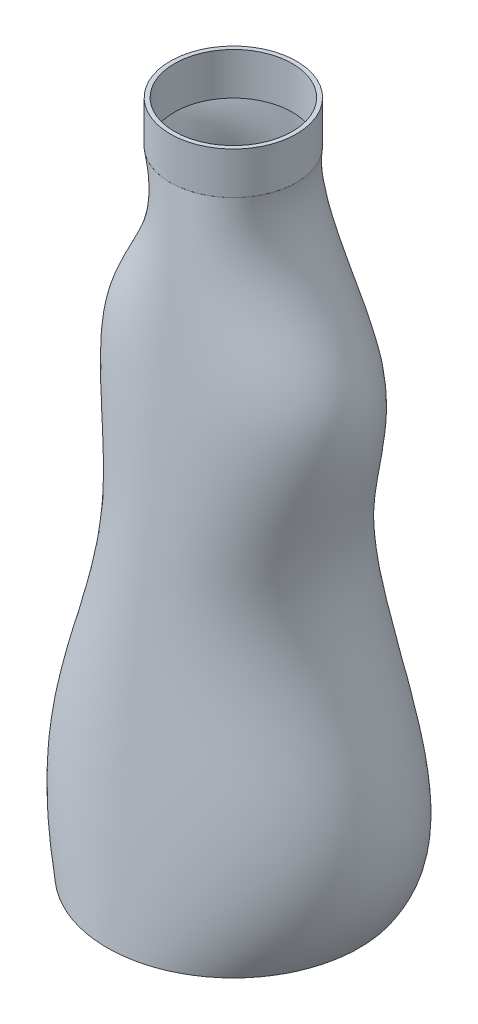
ISO-10303-21;
HEADER;
FILE_DESCRIPTION(('STEP AP214'),'2;1');
FILE_NAME('part.step','',(''),(''),'','','');
FILE_SCHEMA(('AUTOMOTIVE_DESIGN { 1 0 10303 214 1 1 1 1 }'));
ENDSEC;
DATA;
#1=APPLICATION_CONTEXT('core data for automotive mechanical design processes');
#2=APPLICATION_PROTOCOL_DEFINITION('international standard','automotive_design',2000,#1);
#3=PRODUCT_CONTEXT('',#1,'mechanical');
#4=PRODUCT('Part','Part','',(#3));
#5=PRODUCT_RELATED_PRODUCT_CATEGORY('part','',(#4));
#6=PRODUCT_DEFINITION_FORMATION('','',#4);
#7=PRODUCT_DEFINITION_CONTEXT('part definition',#1,'design');
#8=PRODUCT_DEFINITION('design','',#6,#7);
#9=PRODUCT_DEFINITION_SHAPE('','',#8);
#10=(LENGTH_UNIT() NAMED_UNIT(*) SI_UNIT(.MILLI.,.METRE.));
#11=(NAMED_UNIT(*) PLANE_ANGLE_UNIT() SI_UNIT($,.RADIAN.));
#12=(NAMED_UNIT(*) SI_UNIT($,.STERADIAN.) SOLID_ANGLE_UNIT());
#13=UNCERTAINTY_MEASURE_WITH_UNIT(LENGTH_MEASURE(1.E-05),#10,'distance_accuracy_value','');
#14=(GEOMETRIC_REPRESENTATION_CONTEXT(3) GLOBAL_UNCERTAINTY_ASSIGNED_CONTEXT((#13)) GLOBAL_UNIT_ASSIGNED_CONTEXT((#10,
#11,#12)) REPRESENTATION_CONTEXT('',''));
#15=CARTESIAN_POINT('',(0.,0.,0.));
#16=DIRECTION('',(0.,0.,1.));
#17=DIRECTION('',(1.,0.,0.));
#18=AXIS2_PLACEMENT_3D('',#15,#16,#17);
#19=CARTESIAN_POINT('',(0.,160.,0.));
#20=DIRECTION('',(0.,1.,0.));
#21=DIRECTION('',(0.,0.,1.));
#22=AXIS2_PLACEMENT_3D('',#19,#20,#21);
#23=PLANE('',#22);
#24=CARTESIAN_POINT('',(0.,160.,0.));
#25=DIRECTION('',(0.,1.,0.));
#26=DIRECTION('',(0.,0.,1.));
#27=AXIS2_PLACEMENT_3D('',#24,#25,#26);
#28=CIRCLE('',#27,15.);
#29=CARTESIAN_POINT('',(0.,160.,15.));
#30=VERTEX_POINT('',#29);
#31=EDGE_CURVE('E13',#30,#30,#28,.T.);
#32=ORIENTED_EDGE('',*,*,#31,.T.);
#33=EDGE_LOOP('',(#32));
#34=FACE_BOUND('',#33,.T.);
#35=CARTESIAN_POINT('',(0.,160.,0.));
#36=DIRECTION('',(0.,1.,0.));
#37=DIRECTION('',(0.,0.,1.));
#38=AXIS2_PLACEMENT_3D('',#35,#36,#37);
#39=CIRCLE('',#38,14.);
#40=CARTESIAN_POINT('',(0.,160.,14.));
#41=VERTEX_POINT('',#40);
#42=EDGE_CURVE('E104',#41,#41,#39,.T.);
#43=ORIENTED_EDGE('',*,*,#42,.F.);
#44=EDGE_LOOP('',(#43));
#45=FACE_BOUND('',#44,.T.);
#46=ADVANCED_FACE('F91',(#34,#45),#23,.T.);
#47=CARTESIAN_POINT('',(0.,150.,0.));
#48=DIRECTION('',(0.,1.,0.));
#49=DIRECTION('',(0.,0.,1.));
#50=AXIS2_PLACEMENT_3D('',#47,#48,#49);
#51=PLANE('',#50);
#52=CARTESIAN_POINT('',(0.,150.,0.));
#53=DIRECTION('',(0.,1.,0.));
#54=DIRECTION('',(0.,0.,1.));
#55=AXIS2_PLACEMENT_3D('',#52,#53,#54);
#56=CIRCLE('',#55,15.);
#57=CARTESIAN_POINT('',(0.,150.,15.));
#58=VERTEX_POINT('',#57);
#59=EDGE_CURVE('E95',#58,#58,#56,.T.);
#60=ORIENTED_EDGE('',*,*,#59,.F.);
#61=EDGE_LOOP('',(#60));
#62=FACE_BOUND('',#61,.T.);
#63=CARTESIAN_POINT('',(0.,150.,0.));
#64=DIRECTION('',(0.,1.,0.));
#65=DIRECTION('',(0.,0.,1.));
#66=AXIS2_PLACEMENT_3D('',#63,#64,#65);
#67=CIRCLE('',#66,14.);
#68=CARTESIAN_POINT('',(0.,150.,14.));
#69=VERTEX_POINT('',#68);
#70=EDGE_CURVE('E106',#69,#69,#67,.T.);
#71=ORIENTED_EDGE('',*,*,#70,.T.);
#72=EDGE_LOOP('',(#71));
#73=FACE_BOUND('',#72,.T.);
#74=ADVANCED_FACE('F118',(#62,#73),#51,.F.);
#75=CARTESIAN_POINT('',(0.,160.,0.));
#76=DIRECTION('',(0.,-1.,0.));
#77=DIRECTION('',(0.,0.,-1.));
#78=AXIS2_PLACEMENT_3D('',#75,#76,#77);
#79=CYLINDRICAL_SURFACE('',#78,15.);
#80=ORIENTED_EDGE('',*,*,#31,.F.);
#81=EDGE_LOOP('',(#80));
#82=FACE_BOUND('',#81,.T.);
#83=ORIENTED_EDGE('',*,*,#59,.T.);
#84=EDGE_LOOP('',(#83));
#85=FACE_BOUND('',#84,.T.);
#86=ADVANCED_FACE('F93',(#82,#85),#79,.T.);
#87=CARTESIAN_POINT('',(0.,160.,0.));
#88=DIRECTION('',(0.,-1.,0.));
#89=DIRECTION('',(0.,0.,-1.));
#90=AXIS2_PLACEMENT_3D('',#87,#88,#89);
#91=CYLINDRICAL_SURFACE('',#90,14.);
#92=ORIENTED_EDGE('',*,*,#42,.T.);
#93=EDGE_LOOP('',(#92));
#94=FACE_BOUND('',#93,.T.);
#95=ORIENTED_EDGE('',*,*,#70,.F.);
#96=EDGE_LOOP('',(#95));
#97=FACE_BOUND('',#96,.T.);
#98=ADVANCED_FACE('F114',(#94,#97),#91,.F.);
#99=CLOSED_SHELL('',(#46,#74,#86,#98));
#100=MANIFOLD_SOLID_BREP('B2',#99);
#101=CARTESIAN_POINT('',(-15.,150.,9.05048605504E-12));
#102=CARTESIAN_POINT('',(-7.95467335882661,136.319703010843,0.));
#103=CARTESIAN_POINT('',(-22.167178880164,124.484007588772,0.));
#104=CARTESIAN_POINT('',(-26.7282842244557,100.815131363639,0.));
#105=CARTESIAN_POINT('',(-21.9299743230444,87.0723177277878,0.));
#106=CARTESIAN_POINT('',(-22.7907471916141,50.3514765597343,0.));
#107=CARTESIAN_POINT('',(-42.763162800317,26.3102953532345,0.));
#108=CARTESIAN_POINT('',(-30.,0.,6.30348637870037E-11));
#109=CARTESIAN_POINT('',(-15.,150.,-0.924207898323756));
#110=CARTESIAN_POINT('',(-7.95467335882661,136.319703010843,-1.00300104803687));
#111=CARTESIAN_POINT('',(-22.167178880164,124.484007588772,-1.08944172404855));
#112=CARTESIAN_POINT('',(-26.7282842244557,100.815131363639,-1.23899337161657));
#113=CARTESIAN_POINT('',(-21.9299743230444,87.0723177277878,-1.31840309749387));
#114=CARTESIAN_POINT('',(-22.7907471916141,50.3514765597343,-1.540031720978));
#115=CARTESIAN_POINT('',(-42.763162800317,26.3102953532345,-1.69854937290577));
#116=CARTESIAN_POINT('',(-30.,0.,-1.84841579675716));
#117=CARTESIAN_POINT('',(-14.8277305557381,150.,-2.7634941832689));
#118=CARTESIAN_POINT('',(-7.87090558040959,136.316690346913,-2.99769173433498));
#119=CARTESIAN_POINT('',(-21.8715355365745,124.482458997463,-3.26033897363545));
#120=CARTESIAN_POINT('',(-26.3569865002133,100.820037600145,-3.71427633186735));
#121=CARTESIAN_POINT('',(-21.6499844228838,87.0774440269274,-3.95462320211574));
#122=CARTESIAN_POINT('',(-22.5492315629632,50.3527730652556,-4.62587140618732));
#123=CARTESIAN_POINT('',(-42.1641634587696,26.3140378608362,-5.10700025172343));
#124=CARTESIAN_POINT('',(-29.6573557938763,0.,-5.56102145394898));
#125=CARTESIAN_POINT('',(-14.0803696810469,150.,-5.40984495131868));
#126=CARTESIAN_POINT('',(-7.47996828703641,136.304263108206,-5.86265766268574));
#127=CARTESIAN_POINT('',(-20.597173537553,124.476071058313,-6.38870993203111));
#128=CARTESIAN_POINT('',(-24.7543405576161,100.840275825733,-7.29638777611129));
#129=CARTESIAN_POINT('',(-20.4154386899175,87.0985900108783,-7.77481408287762));
#130=CARTESIAN_POINT('',(-21.4497776816758,50.3581211505311,-9.11235416893317));
#131=CARTESIAN_POINT('',(-39.5734111217983,26.3294757046933,-10.0742468112128));
#132=CARTESIAN_POINT('',(-28.1084631643685,0.,-10.9792799560705));
#133=CARTESIAN_POINT('',(-12.8719037225451,150.,-7.85842693573967));
#134=CARTESIAN_POINT('',(-6.81329303507161,136.285057375659,-8.50722883208463));
#135=CARTESIAN_POINT('',(-18.5553501288918,124.466198788719,-9.28469375862589));
#136=CARTESIAN_POINT('',(-22.1882915625447,100.87155308346,-10.6242303603981));
#137=CARTESIAN_POINT('',(-18.4094009597049,87.1312701678935,-11.3275402024259));
#138=CARTESIAN_POINT('',(-19.6280989088162,50.3663863732296,-13.2954791762557));
#139=CARTESIAN_POINT('',(-35.4298408994546,26.3533341906544,-14.7147221551264));
#140=CARTESIAN_POINT('',(-25.5590553143517,0.,-16.04670192565));
#141=CARTESIAN_POINT('',(-11.2541874303604,150.,-10.0403628410517));
#142=CARTESIAN_POINT('',(-5.88585980934822,136.260202898245,-10.8536510409236));
#143=CARTESIAN_POINT('',(-15.8365011091999,124.453422910419,-11.8586342679285));
#144=CARTESIAN_POINT('',(-18.7708486906573,100.912029534635,-13.5876952069661));
#145=CARTESIAN_POINT('',(-15.7060933654478,87.1735621357955,-14.4920748799961));
#146=CARTESIAN_POINT('',(-17.1343240566392,50.3770825437806,-17.0246761036641));
#147=CARTESIAN_POINT('',(-29.9109367739726,26.3842098783687,-18.8561019724151));
#148=CARTESIAN_POINT('',(-22.0843102434634,0.,-20.5707059495825));
#149=CARTESIAN_POINT('',(-9.27907555462046,150.,-11.8867753717744));
#150=CARTESIAN_POINT('',(-4.71604025866252,136.230829424937,-12.8255690580771));
#151=CARTESIAN_POINT('',(-12.5381747940284,124.438324145157,-14.0238089970591));
#152=CARTESIAN_POINT('',(-14.6275711095836,100.95986534057,-16.0822624465797));
#153=CARTESIAN_POINT('',(-12.396706236904,87.2235435524067,-17.154690361128));
#154=CARTESIAN_POINT('',(-14.0450901741538,50.3897234726135,-20.1603085638643));
#155=CARTESIAN_POINT('',(-23.2275143824883,26.4206993274856,-22.3398103663339));
#156=CARTESIAN_POINT('',(-17.7991886308714,0.,-24.3751199038282));
#157=CARTESIAN_POINT('',(-7.01539591690821,150.,-13.3498728296974));
#158=CARTESIAN_POINT('',(-3.34076056461887,136.198066704709,-14.3680795527609));
#159=CARTESIAN_POINT('',(-8.7782089869827,124.421483214671,-15.7153492392906));
#160=CARTESIAN_POINT('',(-9.90730913380359,101.013220662574,-18.0259612198429));
#161=CARTESIAN_POINT('',(-8.59731488736682,87.27929205555,-19.224577070686));
#162=CARTESIAN_POINT('',(-10.4663676133847,50.4038229701579,-22.5866886826892));
#163=CARTESIAN_POINT('',(-15.6229042810837,26.4613990976544,-25.0319568891909));
#164=CARTESIAN_POINT('',(-12.8541740513776,0.,-27.3091538304579));
#165=CARTESIAN_POINT('',(-4.53197633880652,150.,-14.38186351661));
#166=CARTESIAN_POINT('',(-1.79948669194161,136.163044486534,-15.4290990068731));
#167=CARTESIAN_POINT('',(-4.67976756484791,124.403480840704,-16.8742995993839));
#168=CARTESIAN_POINT('',(-4.76905973184618,101.070255661958,-19.348086063821));
#169=CARTESIAN_POINT('',(-4.43670094173885,87.3388852830481,-20.6250327084199));
#170=CARTESIAN_POINT('',(-6.52397691581499,50.4188948468433,-24.2101674032009));
#171=CARTESIAN_POINT('',(-7.36539680233896,26.5049057485245,-26.8263628667003));
#172=CARTESIAN_POINT('',(-7.42954058351129,0.,-29.2550928949908));
#173=CARTESIAN_POINT('',(-1.90820880728182,150.,-14.9593692073532));
#174=CARTESIAN_POINT('',(-0.143191171178197,136.126892519386,-15.9822239871877));
#175=CARTESIAN_POINT('',(-0.37855483842242,124.384897744996,-17.4687743139448));
#176=CARTESIAN_POINT('',(0.613850990808201,101.129130500031,-20.0074052128264));
#177=CARTESIAN_POINT('',(-0.0589249368336713,87.4004008727236,-21.3101051947067));
#178=CARTESIAN_POINT('',(-2.3616683098486,50.4344529130993,-24.9714086028043));
#179=CARTESIAN_POINT('',(1.25689209398311,26.5498158397453,-27.653710754201));
#180=CARTESIAN_POINT('',(-1.72718040078507,0.,-30.1344925180515));
#181=CARTESIAN_POINT('',(0.776514690699449,150.,-15.0590116767678));
#182=CARTESIAN_POINT('',(1.5760706762384,136.090740552239,-16.0047573589449));
#183=CARTESIAN_POINT('',(3.98745420592102,124.366314649288,-17.4746599434055));
#184=CARTESIAN_POINT('',(6.06377108509192,101.188005338105,-19.9774938852961));
#185=CARTESIAN_POINT('',(4.38653548295192,87.4619164623991,-21.2523847352298));
#186=CARTESIAN_POINT('',(1.86834520460366,50.4500109793553,-24.840043485351));
#187=CARTESIAN_POINT('',(9.94520529601329,26.5947259309661,-27.4811067396811));
#188=CARTESIAN_POINT('',(4.03831367745115,0.,-29.9123813197661));
#189=CARTESIAN_POINT('',(3.439475707008,150.,-14.6834904331691));
#190=CARTESIAN_POINT('',(3.30297982079954,136.055718334064,-15.5017095765808));
#191=CARTESIAN_POINT('',(8.27708971752686,124.348312275321,-16.8973386840823));
#192=CARTESIAN_POINT('',(11.3999728448055,101.245040337489,-19.2645164482412));
#193=CARTESIAN_POINT('',(8.74719016023517,87.5215096898973,-20.4586932939982));
#194=CARTESIAN_POINT('',(6.01101462593293,50.4650828560407,-23.82451945572));
#195=CARTESIAN_POINT('',(18.3980759381141,26.6382325818362,-26.3177521888561));
#196=CARTESIAN_POINT('',(9.64975843592687,0.,-28.5989831219045));
#197=CARTESIAN_POINT('',(5.99795579351456,150.,-13.8355049848722));
#198=CARTESIAN_POINT('',(4.98286946577293,136.022955613836,-14.4818968371431));
#199=CARTESIAN_POINT('',(12.3505496158731,124.331471344836,-15.7501735962852));
#200=CARTESIAN_POINT('',(16.4443342903128,101.298395659493,-17.8898415407916));
#201=CARTESIAN_POINT('',(12.8738120008581,87.5772581930406,-18.9548926306433));
#202=CARTESIAN_POINT('',(9.91638860991665,50.4791823535851,-21.9630284711016));
#203=CARTESIAN_POINT('',(26.3204469871232,26.678932352005,-24.2102494896985));
#204=CARTESIAN_POINT('',(14.8976210539275,0.,-26.2491613804502));
#205=CARTESIAN_POINT('',(8.37333376724309,150.,-12.5440385171603));
#206=CARTESIAN_POINT('',(6.56626921784566,135.993582140528,-12.9817148371162));
#207=CARTESIAN_POINT('',(16.0744340425749,124.316372579573,-14.0755288325083));
#208=CARTESIAN_POINT('',(21.027221859923,101.346231465428,-15.9062984023008));
#209=CARTESIAN_POINT('',(16.626770067907,87.6272396096517,-16.7996110676241));
#210=CARTESIAN_POINT('',(13.4472036152571,50.491823282418,-19.3301739286521));
#211=CARTESIAN_POINT('',(33.4321604813936,26.7154218011219,-21.2442194319933));
#212=CARTESIAN_POINT('',(19.5893583690874,0.,-22.9592626380116));
#213=CARTESIAN_POINT('',(10.4869884452176,150.,-10.8380742153162));
#214=CARTESIAN_POINT('',(8.00590965377287,135.968727663114,-11.0406508053908));
#215=CARTESIAN_POINT('',(19.3199587017172,124.303596701274,-11.9222516688263));
#216=CARTESIAN_POINT('',(24.9877950584381,101.386707916603,-13.379067212469));
#217=CARTESIAN_POINT('',(19.8774446841725,87.6695315775537,-14.0669435921701));
#218=CARTESIAN_POINT('',(16.4833982280738,50.502519452969,-16.0247217233023));
#219=CARTESIAN_POINT('',(39.4746885427865,26.7462974888362,-17.5356649107124));
#220=CARTESIAN_POINT('',(23.558243599384,0.,-18.8618957097327));
#221=CARTESIAN_POINT('',(12.2714350017375,150.,-8.77126648497149));
#222=CARTESIAN_POINT('',(9.26746969947951,135.949521930567,-8.72325565603079));
#223=CARTESIAN_POINT('',(21.9732755072359,124.293724431679,-9.36468362326683));
#224=CARTESIAN_POINT('',(28.1835888128569,101.41798517433,-10.3995673023917));
#225=CARTESIAN_POINT('',(22.5174177658272,87.7022117345688,-10.8576198788668));
#226=CARTESIAN_POINT('',(18.930209381467,50.5107846756675,-12.1731763586731));
#227=CARTESIAN_POINT('',(44.2184470420787,26.7701559747972,-13.2291169981889));
#228=CARTESIAN_POINT('',(26.6699401629107,0.,-14.1189440654462));
#229=CARTESIAN_POINT('',(13.6591886111024,150.,-6.39726973175732));
#230=CARTESIAN_POINT('',(10.3198378930239,135.937094691859,-6.09585763053348));
#231=CARTESIAN_POINT('',(23.927267116715,124.287336492529,-6.48089337303864));
#232=CARTESIAN_POINT('',(30.4849607292844,101.438223399918,-7.06631858055345));
#233=CARTESIAN_POINT('',(24.4543286363042,87.7233577185198,-7.2812614151552));
#234=CARTESIAN_POINT('',(20.7179593823361,50.5161327609429,-7.91593340097258));
#235=CARTESIAN_POINT('',(47.4653943864409,26.7855938186544,-8.48657349261429));
#236=CARTESIAN_POINT('',(28.8277587719206,0.,-8.91313841942317));
#237=CARTESIAN_POINT('',(14.287665451931,150.,-4.66012619711323));
#238=CARTESIAN_POINT('',(10.8751387656181,135.93408202793,-4.19580744240405));
#239=CARTESIAN_POINT('',(24.7075018276726,124.28578790122,-4.40633033905837));
#240=CARTESIAN_POINT('',(31.3539117591397,101.443129636424,-4.6863637162739));
#241=CARTESIAN_POINT('',(25.2339069819322,87.7284840176593,-4.73722708516494));
#242=CARTESIAN_POINT('',(21.4458291484956,50.5174292664642,-4.91118169573419));
#243=CARTESIAN_POINT('',(48.5243295531183,26.7893363262561,-5.15139287133595));
#244=CARTESIAN_POINT('',(29.5923470147349,0.,-5.26399459699668));
#245=CARTESIAN_POINT('',(14.7805699576064,150.,-2.75950543045058));
#246=CARTESIAN_POINT('',(11.3849481728508,135.93408202793,-2.12961323882681));
#247=CARTESIAN_POINT('',(25.2316022994327,124.28578790122,-2.15677736405663));
#248=CARTESIAN_POINT('',(31.8919387820162,101.443129636424,-2.11618646287646));
#249=CARTESIAN_POINT('',(25.7736627885576,87.7284840176593,-1.99540517666622));
#250=CARTESIAN_POINT('',(21.9692948261949,50.5174292664642,-1.68664633006411));
#251=CARTESIAN_POINT('',(49.0169352926142,26.7893363262561,-1.57941388545242));
#252=CARTESIAN_POINT('',(30.0410297277784,0.,-1.36272039141552));
#253=CARTESIAN_POINT('',(15.0922725668329,150.,-0.684554222597238));
#254=CARTESIAN_POINT('',(11.7946663677356,135.937094691859,0.114646395355562));
#255=CARTESIAN_POINT('',(25.4361916180255,124.287336492529,0.280430085278462));
#256=CARTESIAN_POINT('',(32.0231790740801,101.438223399918,0.657314906343572));
#257=CARTESIAN_POINT('',(25.9925200534281,87.7233577185197,0.957188710889697));
#258=CARTESIAN_POINT('',(22.1980091784136,50.5161327609429,1.76941421982859));
#259=CARTESIAN_POINT('',(48.851035357193,26.7855938186544,2.23966911932784));
#260=CARTESIAN_POINT('',(30.0835882958598,0.,2.79942894239995));
#261=CARTESIAN_POINT('',(14.9092202038711,150.,2.47700622480828));
#262=CARTESIAN_POINT('',(11.9655359245134,135.949521930567,3.50338566110094));
#263=CARTESIAN_POINT('',(24.7174968621225,124.293724431679,3.94333782193483));
#264=CARTESIAN_POINT('',(30.9569610496404,101.41798517433,4.79529336336801));
#265=CARTESIAN_POINT('',(25.2796650041254,87.7022117345687,5.34568814178303));
#266=CARTESIAN_POINT('',(21.5622654040142,50.5107846756674,6.86185126045047));
#267=CARTESIAN_POINT('',(46.6671947848337,26.7701559747972,7.84154142127975));
#268=CARTESIAN_POINT('',(28.8761406678109,0.,8.8800691413998));
#269=CARTESIAN_POINT('',(14.0552277202822,150.,5.54802624131384));
#270=CARTESIAN_POINT('',(11.6430046152447,135.968727663114,6.76719411726017));
#271=CARTESIAN_POINT('',(23.0069318222546,124.303596701274,7.45567375017954));
#272=CARTESIAN_POINT('',(28.6959341472756,101.386707916603,8.7357355877943));
#273=CARTESIAN_POINT('',(23.5626494674184,87.6695315775537,9.50953180471057));
#274=CARTESIAN_POINT('',(19.9772441767578,50.5025194529689,11.6532943440638));
#275=CARTESIAN_POINT('',(42.7158152139608,26.7462974888362,13.0891313270041));
#276=CARTESIAN_POINT('',(26.4714987326123,0.,14.553764914739));
#277=CARTESIAN_POINT('',(12.5749834699442,150.,8.38791181353351));
#278=CARTESIAN_POINT('',(10.8404298947317,135.993582140528,9.75985406920887));
#279=CARTESIAN_POINT('',(20.399092559867,124.316372579573,10.6630077592051));
#280=CARTESIAN_POINT('',(25.3655133865839,101.346231465428,12.3103807599022));
#281=CARTESIAN_POINT('',(20.9336122967326,87.6272396096518,13.273455541018));
#282=CARTESIAN_POINT('',(17.5220960080823,50.491823282418,15.9489809223638));
#283=CARTESIAN_POINT('',(37.2099944471501,26.7154218011219,17.7734754606047));
#284=CARTESIAN_POINT('',(22.9856497419829,0.,19.5984939309405));
#285=CARTESIAN_POINT('',(10.5131758067351,150.,10.8560689280813));
#286=CARTESIAN_POINT('',(9.57437200942687,136.022955613836,12.3375872167494));
#287=CARTESIAN_POINT('',(16.9952915771028,124.331471344836,13.4160252904454));
#288=CARTESIAN_POINT('',(21.1039092178491,101.298395659493,15.3607136524756));
#289=CARTESIAN_POINT('',(17.5007156304782,87.5772581930405,16.4743992678557));
#290=CARTESIAN_POINT('',(14.3010034763599,50.4791823535851,19.5732140283364));
#291=CARTESIAN_POINT('',(30.3943057949213,26.678932352005,21.7095836505127));
#292=CARTESIAN_POINT('',(18.5721482406325,0.,23.8208468484278));
#293=CARTESIAN_POINT('',(7.97332320716747,150.,12.8435225298613));
#294=CARTESIAN_POINT('',(7.9178543519894,136.055718334064,14.3884355563011));
#295=CARTESIAN_POINT('',(12.9507078112613,124.348312275321,15.5974529618267));
#296=CARTESIAN_POINT('',(16.0987059376769,101.245040337489,17.7606423606841));
#297=CARTESIAN_POINT('',(13.4191099547746,87.5215096898972,18.9819291386097));
#298=CARTESIAN_POINT('',(10.4584796988456,50.4650828560407,22.3834892537384));
#299=CARTESIAN_POINT('',(22.5488911756341,26.6382325818362,24.7460633404484));
#300=CARTESIAN_POINT('',(13.4156153362751,0.,27.0613948911472));
#301=CARTESIAN_POINT('',(5.05894414775401,150.,14.2412975637775));
#302=CARTESIAN_POINT('',(5.94600704123709,136.090740552239,15.8037047504521));
#303=CARTESIAN_POINT('',(8.42493812714203,124.366314649288,17.0968614893846));
#304=CARTESIAN_POINT('',(10.5459043965663,101.188005338105,19.3971136093674));
#305=CARTESIAN_POINT('',(8.85448552145438,87.4619164623991,20.6819391415118));
#306=CARTESIAN_POINT('',(6.15550333784666,50.4500109793552,24.2628100343884));
#307=CARTESIAN_POINT('',(13.9745964069882,26.5947259309661,26.7635957277896));
#308=CARTESIAN_POINT('',(7.72538307866728,0.,29.198990606515));
#309=CARTESIAN_POINT('',(1.91291323793201,150.,14.9962495082605));
#310=CARTESIAN_POINT('',(3.77145426587506,136.126892519386,16.5293104102369));
#311=CARTESIAN_POINT('',(3.61303066778908,124.384897744996,17.8570924846525));
#312=CARTESIAN_POINT('',(4.67342247445705,101.129130500031,20.2080283135349));
#313=CARTESIAN_POINT('',(4.00257297764226,87.4004008727236,21.5100473184986));
#314=CARTESIAN_POINT('',(1.57785585772819,50.4344529130993,25.1404706096841));
#315=CARTESIAN_POINT('',(4.99332397266826,26.5498158397453,27.6866972157466));
#316=CARTESIAN_POINT('',(1.72829849585878,0.,30.1540001662501));
#317=CARTESIAN_POINT('',(-1.32189491286116,150.,15.0552338417409));
#318=CARTESIAN_POINT('',(1.50768662131223,136.163044486534,16.5148902428328));
#319=CARTESIAN_POINT('',(-1.28814951841549,124.403480840704,17.8287930116381));
#320=CARTESIAN_POINT('',(-1.28736057871517,101.070255661958,20.1461574854096));
#321=CARTESIAN_POINT('',(-0.936562472986928,87.338885283048,21.4204930311997));
#322=CARTESIAN_POINT('',(-3.0819097000434,50.4188948468433,24.974856015411));
#323=CARTESIAN_POINT('',(-4.06450901201289,26.5049057485245,27.4764631922053));
#324=CARTESIAN_POINT('',(-4.33862882654446,0.,29.8904482411519));
#325=CARTESIAN_POINT('',(-4.49383970224502,150.,14.4338268893436));
#326=CARTESIAN_POINT('',(-0.723568539379961,136.198066704709,15.7767493916098));
#327=CARTESIAN_POINT('',(-6.07408122736515,124.421483214671,17.0270248595827));
#328=CARTESIAN_POINT('',(-7.09841386096149,101.013220662574,19.2247894306948));
#329=CARTESIAN_POINT('',(-5.75673735138488,87.27929205555,20.4259634557711));
#330=CARTESIAN_POINT('',(-7.62661064660125,50.4038229701579,23.7770232883171));
#331=CARTESIAN_POINT('',(-12.8649205105816,26.4613990976544,26.1425299532435));
#332=CARTESIAN_POINT('',(-10.2358309997268,0.,28.4169947751437));
#333=CARTESIAN_POINT('',(-7.45128052783904,150.,13.1476049761932));
#334=CARTESIAN_POINT('',(-2.80101932377267,136.230829424937,14.3349897135563));
#335=CARTESIAN_POINT('',(-10.5411564412925,124.438324145157,15.4748117473963));
#336=CARTESIAN_POINT('',(-12.5234461733637,100.95986534057,17.4723806556004));
#337=CARTESIAN_POINT('',(-10.2539467498053,87.2235435524067,18.5581403927307));
#338=CARTESIAN_POINT('',(-11.8624677239423,50.3897234726135,21.5877034495346));
#339=CARTESIAN_POINT('',(-21.0782079859545,26.4206993274856,23.7318460845576));
#340=CARTESIAN_POINT('',(-15.728847890647,0.,25.7868334403659));
#341=CARTESIAN_POINT('',(-10.0666572929874,150.,11.2760669032481));
#342=CARTESIAN_POINT('',(-4.62648044451405,136.260202898245,12.2718725136051));
#343=CARTESIAN_POINT('',(-14.5078053217536,124.453422910419,13.2554026976176));
#344=CARTESIAN_POINT('',(-17.3463560050941,100.912029534635,14.9742666927001));
#345=CARTESIAN_POINT('',(-14.2433939269279,87.1735621357954,15.9038078449351));
#346=CARTESIAN_POINT('',(-15.6121704619928,50.3770825437806,18.4977706944239));
#347=CARTESIAN_POINT('',(-28.3891783759609,26.3842098783687,20.337956450913));
#348=CARTESIAN_POINT('',(-20.5958764592387,0.,22.096400867517));
#349=CARTESIAN_POINT('',(-12.2124099010343,150.,8.89871147146682));
#350=CARTESIAN_POINT('',(-6.10348665033193,136.285057375659,9.673142096524));
#351=CARTESIAN_POINT('',(-17.7960650461792,124.466198788719,10.4593507863728));
#352=CARTESIAN_POINT('',(-21.3579135387838,100.87155308346,11.8296979612758));
#353=CARTESIAN_POINT('',(-17.5488873306847,87.1312701678935,12.5671749571325));
#354=CARTESIAN_POINT('',(-18.711851681088,50.3663863732296,14.6253213091089));
#355=CARTESIAN_POINT('',(-34.4995423122059,26.3533341906544,16.0886351773395));
#356=CARTESIAN_POINT('',(-24.6352889082898,0.,17.4829876951648));
#357=CARTESIAN_POINT('',(-13.8099870924319,150.,6.14041231776176));
#358=CARTESIAN_POINT('',(-7.18270351697612,136.304263108206,6.66922983106194));
#359=CARTESIAN_POINT('',(-20.2730433325377,124.476071058313,7.221141627842));
#360=CARTESIAN_POINT('',(-24.3903949808434,100.840275825733,8.18055200782407));
#361=CARTESIAN_POINT('',(-20.0338487268009,87.0985900108783,8.69438484732397));
#362=CARTESIAN_POINT('',(-21.0319750704141,50.3581211505311,10.1284509944889));
#363=CARTESIAN_POINT('',(-39.141563076478,26.3294757046934,11.1502721300794));
#364=CARTESIAN_POINT('',(-27.6724380714173,0.,12.1211921446207));
#365=CARTESIAN_POINT('',(-14.7808376076326,150.,3.12604307904537));
#366=CARTESIAN_POINT('',(-7.81769972208162,136.316690346913,3.39335644413237));
#367=CARTESIAN_POINT('',(-21.8119358725965,124.482458997463,3.68111028279525));
#368=CARTESIAN_POINT('',(-26.2876746817398,100.820037600145,4.17985010685978));
#369=CARTESIAN_POINT('',(-21.5762238444441,87.0774440269274,4.44553554712138));
#370=CARTESIAN_POINT('',(-22.4656941000226,50.3527730652556,5.18705624524019));
#371=CARTESIAN_POINT('',(-42.0760342505097,26.3140378608362,5.71666965631305));
#372=CARTESIAN_POINT('',(-29.5667288502477,0.,6.21833034296789));
#373=CARTESIAN_POINT('',(-15.,150.,1.03928749265234));
#374=CARTESIAN_POINT('',(-7.95467335882661,136.319703010843,1.12789172892079));
#375=CARTESIAN_POINT('',(-22.167178880164,124.484007588772,1.22509573853445));
#376=CARTESIAN_POINT('',(-26.7282842244557,100.815131363639,1.39326910851108));
#377=CARTESIAN_POINT('',(-21.9299743230444,87.0723177277878,1.48256669517679));
#378=CARTESIAN_POINT('',(-22.7907471916141,50.3514765597343,1.73179184983551));
#379=CARTESIAN_POINT('',(-42.763162800317,26.3102953532345,1.91004764413125));
#380=CARTESIAN_POINT('',(-30.,0.,2.07857498552345));
#381=CARTESIAN_POINT('',(-15.,150.,9.05048605504E-12));
#382=CARTESIAN_POINT('',(-7.95467335882661,136.319703010843,0.));
#383=CARTESIAN_POINT('',(-22.167178880164,124.484007588772,0.));
#384=CARTESIAN_POINT('',(-26.7282842244557,100.815131363639,0.));
#385=CARTESIAN_POINT('',(-21.9299743230444,87.0723177277878,0.));
#386=CARTESIAN_POINT('',(-22.7907471916141,50.3514765597343,0.));
#387=CARTESIAN_POINT('',(-42.763162800317,26.3102953532345,0.));
#388=CARTESIAN_POINT('',(-30.,0.,6.30348637870037E-11));
#389=B_SPLINE_SURFACE_WITH_KNOTS('',3,3,((#101,#102,#103,#104,#105,#106,#107,#108),(#109,#110,
#111,#112,#113,#114,#115,#116),(#117,#118,#119,#120,#121,#122,#123,#124),(#125,#126,#127,#128,
#129,#130,#131,#132),(#133,#134,#135,#136,#137,#138,#139,#140),(#141,#142,#143,#144,#145,#146,
#147,#148),(#149,#150,#151,#152,#153,#154,#155,#156),(#157,#158,#159,#160,#161,#162,#163,#164),
(#165,#166,#167,#168,#169,#170,#171,#172),(#173,#174,#175,#176,#177,#178,#179,#180),(#181,#182,
#183,#184,#185,#186,#187,#188),(#189,#190,#191,#192,#193,#194,#195,#196),(#197,#198,#199,#200,
#201,#202,#203,#204),(#205,#206,#207,#208,#209,#210,#211,#212),(#213,#214,#215,#216,#217,#218,
#219,#220),(#221,#222,#223,#224,#225,#226,#227,#228),(#229,#230,#231,#232,#233,#234,#235,#236),
(#237,#238,#239,#240,#241,#242,#243,#244),(#245,#246,#247,#248,#249,#250,#251,#252),(#253,#254,
#255,#256,#257,#258,#259,#260),(#261,#262,#263,#264,#265,#266,#267,#268),(#269,#270,#271,#272,
#273,#274,#275,#276),(#277,#278,#279,#280,#281,#282,#283,#284),(#285,#286,#287,#288,#289,#290,
#291,#292),(#293,#294,#295,#296,#297,#298,#299,#300),(#301,#302,#303,#304,#305,#306,#307,#308),
(#309,#310,#311,#312,#313,#314,#315,#316),(#317,#318,#319,#320,#321,#322,#323,#324),(#325,#326,
#327,#328,#329,#330,#331,#332),(#333,#334,#335,#336,#337,#338,#339,#340),(#341,#342,#343,#344,
#345,#346,#347,#348),(#349,#350,#351,#352,#353,#354,#355,#356),(#357,#358,#359,#360,#361,#362,
#363,#364),(#365,#366,#367,#368,#369,#370,#371,#372),(#373,#374,#375,#376,#377,#378,#379,#380),
(#381,#382,#383,#384,#385,#386,#387,#388)),.UNSPECIFIED.,.T.,.F.,.F.,(4,1,1,1,1,1,1,1,1,1,1,1,1,
1,1,1,2,1,1,1,1,1,1,1,1,1,1,1,1,1,1,1,4),(4,1,1,1,1,4),(0.,0.0294184513553073,
0.0588369027106145,0.0882553540659217,0.117673805421229,0.147092256776536,0.176510708131844,
0.205929159487151,0.235347610842458,0.264766062197765,0.294184513553073,0.32360296490838,
0.353021416263687,0.382439867618994,0.411858318974302,0.441276770329609,0.470695221684916,
0.503776770329609,0.536858318974302,0.569939867618994,0.603021416263687,0.63610296490838,
0.669184513553073,0.702266062197765,0.735347610842458,0.768429159487151,0.801510708131843,
0.834592256776536,0.867673805421229,0.900755354065922,0.933836902710614,0.966918451355307,1.),
(0.,0.255764368059473,0.280588413558722,0.485448072277212,0.513530156494957,1.),.UNSPECIFIED.);
#390=CARTESIAN_POINT('',(-15.,150.,9.05048605504E-12));
#391=CARTESIAN_POINT('',(-15.,150.,-0.924207898323756));
#392=CARTESIAN_POINT('',(-14.8277305557381,150.,-2.7634941832689));
#393=CARTESIAN_POINT('',(-14.0803696810469,150.,-5.40984495131868));
#394=CARTESIAN_POINT('',(-12.8719037225451,150.,-7.85842693573967));
#395=CARTESIAN_POINT('',(-11.2541874303604,150.,-10.0403628410517));
#396=CARTESIAN_POINT('',(-9.27907555462046,150.,-11.8867753717744));
#397=CARTESIAN_POINT('',(-7.01539591690821,150.,-13.3498728296974));
#398=CARTESIAN_POINT('',(-4.53197633880652,150.,-14.38186351661));
#399=CARTESIAN_POINT('',(-1.90820880728182,150.,-14.9593692073532));
#400=CARTESIAN_POINT('',(0.776514690699449,150.,-15.0590116767678));
#401=CARTESIAN_POINT('',(3.439475707008,150.,-14.6834904331691));
#402=CARTESIAN_POINT('',(5.99795579351456,150.,-13.8355049848722));
#403=CARTESIAN_POINT('',(8.37333376724309,150.,-12.5440385171603));
#404=CARTESIAN_POINT('',(10.4869884452176,150.,-10.8380742153162));
#405=CARTESIAN_POINT('',(12.2714350017375,150.,-8.77126648497149));
#406=CARTESIAN_POINT('',(13.6591886111024,150.,-6.39726973175732));
#407=CARTESIAN_POINT('',(14.287665451931,150.,-4.66012619711323));
#408=CARTESIAN_POINT('',(14.7805699576064,150.,-2.75950543045058));
#409=CARTESIAN_POINT('',(15.0922725668329,150.,-0.684554222597238));
#410=CARTESIAN_POINT('',(14.9092202038711,150.,2.47700622480828));
#411=CARTESIAN_POINT('',(14.0552277202822,150.,5.54802624131384));
#412=CARTESIAN_POINT('',(12.5749834699442,150.,8.38791181353351));
#413=CARTESIAN_POINT('',(10.5131758067351,150.,10.8560689280813));
#414=CARTESIAN_POINT('',(7.97332320716747,150.,12.8435225298613));
#415=CARTESIAN_POINT('',(5.05894414775401,150.,14.2412975637775));
#416=CARTESIAN_POINT('',(1.91291323793201,150.,14.9962495082605));
#417=CARTESIAN_POINT('',(-1.32189491286116,150.,15.0552338417409));
#418=CARTESIAN_POINT('',(-4.49383970224502,150.,14.4338268893436));
#419=CARTESIAN_POINT('',(-7.45128052783904,150.,13.1476049761932));
#420=CARTESIAN_POINT('',(-10.0666572929874,150.,11.2760669032481));
#421=CARTESIAN_POINT('',(-12.2124099010343,150.,8.89871147146682));
#422=CARTESIAN_POINT('',(-13.8099870924319,150.,6.14041231776176));
#423=CARTESIAN_POINT('',(-14.7808376076326,150.,3.12604307904537));
#424=CARTESIAN_POINT('',(-15.,150.,1.03928749265234));
#425=CARTESIAN_POINT('',(-15.,150.,9.05048605504E-12));
#426=B_SPLINE_CURVE_WITH_KNOTS('',3,(#390,#391,#392,#393,#394,#395,#396,#397,#398,#399,#400,
#401,#402,#403,#404,#405,#406,#407,#408,#409,#410,#411,#412,#413,#414,#415,#416,#417,#418,#419,
#420,#421,#422,#423,#424,#425),.UNSPECIFIED.,.T.,.F.,(4,1,1,1,1,1,1,1,1,1,1,1,1,1,1,1,2,1,1,1,1,
1,1,1,1,1,1,1,1,1,1,1,4),(0.,0.0294184513553073,0.0588369027106145,0.0882553540659217,
0.117673805421229,0.147092256776536,0.176510708131844,0.205929159487151,0.235347610842458,
0.264766062197765,0.294184513553073,0.32360296490838,0.353021416263687,0.382439867618994,
0.411858318974302,0.441276770329609,0.470695221684916,0.503776770329609,0.536858318974302,
0.569939867618994,0.603021416263687,0.63610296490838,0.669184513553073,0.702266062197765,
0.735347610842458,0.768429159487151,0.801510708131843,0.834592256776536,0.867673805421229,
0.900755354065922,0.933836902710614,0.966918451355307,1.),.UNSPECIFIED.);
#427=CARTESIAN_POINT('',(-15.,150.,9.05048605504E-12));
#428=VERTEX_POINT('',#427);
#429=EDGE_CURVE('E90',#428,#428,#426,.T.);
#430=CARTESIAN_POINT('',(-30.,0.,6.30348637870037E-11));
#431=CARTESIAN_POINT('',(-30.,0.,-1.84841579675716));
#432=CARTESIAN_POINT('',(-29.6573557938763,0.,-5.56102145394898));
#433=CARTESIAN_POINT('',(-28.1084631643685,0.,-10.9792799560705));
#434=CARTESIAN_POINT('',(-25.5590553143517,0.,-16.04670192565));
#435=CARTESIAN_POINT('',(-22.0843102434634,0.,-20.5707059495825));
#436=CARTESIAN_POINT('',(-17.7991886308714,0.,-24.3751199038282));
#437=CARTESIAN_POINT('',(-12.8541740513776,0.,-27.3091538304579));
#438=CARTESIAN_POINT('',(-7.42954058351129,0.,-29.2550928949908));
#439=CARTESIAN_POINT('',(-1.72718040078507,0.,-30.1344925180515));
#440=CARTESIAN_POINT('',(4.03831367745115,0.,-29.9123813197661));
#441=CARTESIAN_POINT('',(9.64975843592687,0.,-28.5989831219045));
#442=CARTESIAN_POINT('',(14.8976210539275,0.,-26.2491613804502));
#443=CARTESIAN_POINT('',(19.5893583690874,0.,-22.9592626380116));
#444=CARTESIAN_POINT('',(23.558243599384,0.,-18.8618957097327));
#445=CARTESIAN_POINT('',(26.6699401629107,0.,-14.1189440654462));
#446=CARTESIAN_POINT('',(28.8277587719206,0.,-8.91313841942317));
#447=CARTESIAN_POINT('',(29.5923470147349,0.,-5.26399459699668));
#448=CARTESIAN_POINT('',(30.0410297277784,0.,-1.36272039141552));
#449=CARTESIAN_POINT('',(30.0835882958598,0.,2.79942894239995));
#450=CARTESIAN_POINT('',(28.8761406678109,0.,8.8800691413998));
#451=CARTESIAN_POINT('',(26.4714987326123,0.,14.553764914739));
#452=CARTESIAN_POINT('',(22.9856497419829,0.,19.5984939309405));
#453=CARTESIAN_POINT('',(18.5721482406325,0.,23.8208468484278));
#454=CARTESIAN_POINT('',(13.4156153362751,0.,27.0613948911472));
#455=CARTESIAN_POINT('',(7.72538307866728,0.,29.198990606515));
#456=CARTESIAN_POINT('',(1.72829849585878,0.,30.1540001662501));
#457=CARTESIAN_POINT('',(-4.33862882654446,0.,29.8904482411519));
#458=CARTESIAN_POINT('',(-10.2358309997268,0.,28.4169947751437));
#459=CARTESIAN_POINT('',(-15.728847890647,0.,25.7868334403659));
#460=CARTESIAN_POINT('',(-20.5958764592387,0.,22.096400867517));
#461=CARTESIAN_POINT('',(-24.6352889082898,0.,17.4829876951648));
#462=CARTESIAN_POINT('',(-27.6724380714173,0.,12.1211921446207));
#463=CARTESIAN_POINT('',(-29.5667288502477,0.,6.21833034296789));
#464=CARTESIAN_POINT('',(-30.,0.,2.07857498552345));
#465=CARTESIAN_POINT('',(-30.,0.,6.30348637870037E-11));
#466=B_SPLINE_CURVE_WITH_KNOTS('',3,(#430,#431,#432,#433,#434,#435,#436,#437,#438,#439,#440,
#441,#442,#443,#444,#445,#446,#447,#448,#449,#450,#451,#452,#453,#454,#455,#456,#457,#458,#459,
#460,#461,#462,#463,#464,#465),.UNSPECIFIED.,.T.,.F.,(4,1,1,1,1,1,1,1,1,1,1,1,1,1,1,1,2,1,1,1,1,
1,1,1,1,1,1,1,1,1,1,1,4),(0.,0.0294184513553073,0.0588369027106145,0.0882553540659217,
0.117673805421229,0.147092256776536,0.176510708131844,0.205929159487151,0.235347610842458,
0.264766062197765,0.294184513553073,0.32360296490838,0.353021416263687,0.382439867618994,
0.411858318974302,0.441276770329609,0.470695221684916,0.503776770329609,0.536858318974302,
0.569939867618994,0.603021416263687,0.63610296490838,0.669184513553073,0.702266062197765,
0.735347610842458,0.768429159487151,0.801510708131843,0.834592256776536,0.867673805421229,
0.900755354065922,0.933836902710614,0.966918451355307,1.),.UNSPECIFIED.);
#467=CARTESIAN_POINT('',(-30.,0.,6.30348637870037E-11));
#468=VERTEX_POINT('',#467);
#469=EDGE_CURVE('E160',#468,#468,#466,.F.);
#470=ORIENTED_EDGE('',*,*,#429,.T.);
#471=EDGE_LOOP('',(#470));
#472=FACE_BOUND('',#471,.T.);
#473=ORIENTED_EDGE('',*,*,#469,.T.);
#474=EDGE_LOOP('',(#473));
#475=FACE_BOUND('',#474,.T.);
#476=ADVANCED_FACE('F157',(#472,#475),#389,.T.);
#477=OPEN_SHELL('',(#476));
#478=SHELL_BASED_SURFACE_MODEL('B8',(#477));
#479=ADVANCED_BREP_SHAPE_REPRESENTATION('',(#18,#100),#14);
#480=MANIFOLD_SURFACE_SHAPE_REPRESENTATION('',(#18,#478),#14);
#481=SHAPE_REPRESENTATION('',(#18),#14);
#482=SHAPE_DEFINITION_REPRESENTATION(#9,#481);
#483=SHAPE_REPRESENTATION_RELATIONSHIP('','',#481,#479);
#484=SHAPE_REPRESENTATION_RELATIONSHIP('','',#481,#480);
ENDSEC;
END-ISO-10303-21;
